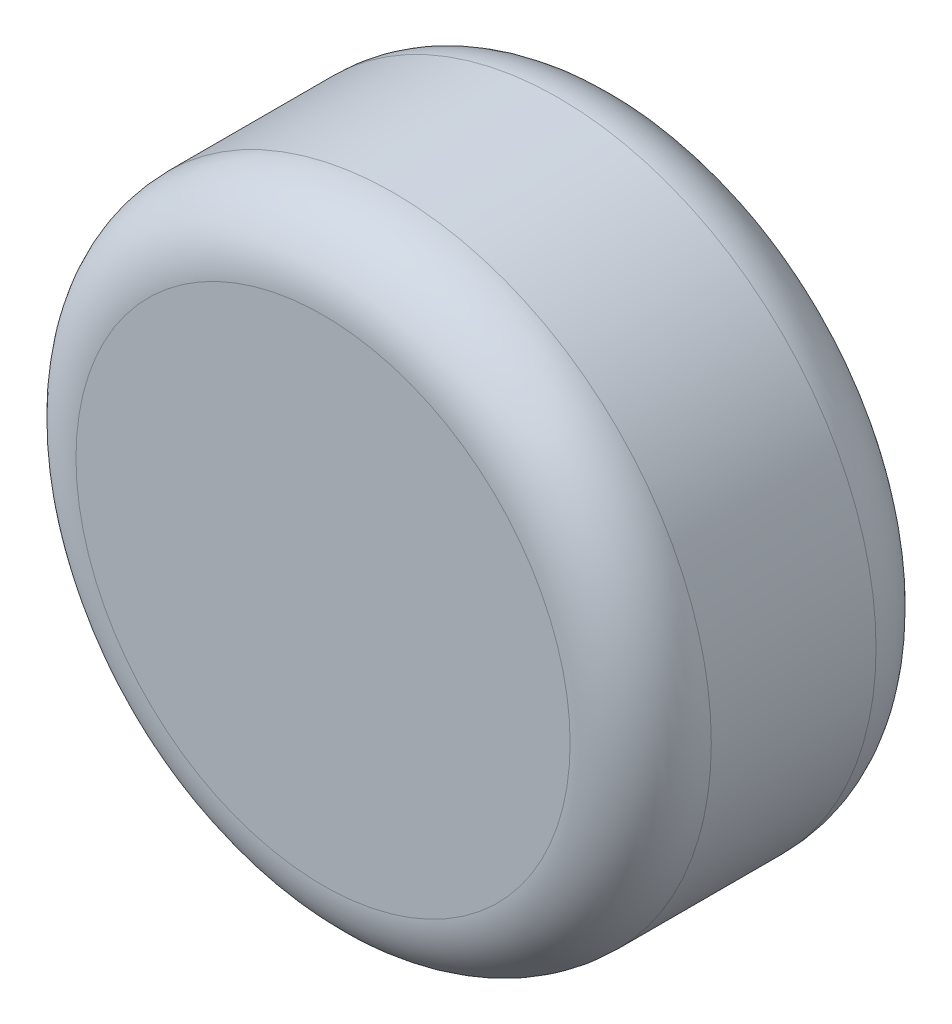
ISO-10303-21;
HEADER;
FILE_DESCRIPTION(('STEP AP214'),'2;1');
FILE_NAME('part.step','',(''),(''),'','','');
FILE_SCHEMA(('AUTOMOTIVE_DESIGN { 1 0 10303 214 1 1 1 1 }'));
ENDSEC;
DATA;
#1=APPLICATION_CONTEXT('core data for automotive mechanical design processes');
#2=APPLICATION_PROTOCOL_DEFINITION('international standard','automotive_design',2000,#1);
#3=PRODUCT_CONTEXT('',#1,'mechanical');
#4=PRODUCT('Part','Part','',(#3));
#5=PRODUCT_RELATED_PRODUCT_CATEGORY('part','',(#4));
#6=PRODUCT_DEFINITION_FORMATION('','',#4);
#7=PRODUCT_DEFINITION_CONTEXT('part definition',#1,'design');
#8=PRODUCT_DEFINITION('design','',#6,#7);
#9=PRODUCT_DEFINITION_SHAPE('','',#8);
#10=(LENGTH_UNIT() NAMED_UNIT(*) SI_UNIT(.MILLI.,.METRE.));
#11=(NAMED_UNIT(*) PLANE_ANGLE_UNIT() SI_UNIT($,.RADIAN.));
#12=(NAMED_UNIT(*) SI_UNIT($,.STERADIAN.) SOLID_ANGLE_UNIT());
#13=UNCERTAINTY_MEASURE_WITH_UNIT(LENGTH_MEASURE(1.E-05),#10,'distance_accuracy_value','');
#14=(GEOMETRIC_REPRESENTATION_CONTEXT(3) GLOBAL_UNCERTAINTY_ASSIGNED_CONTEXT((#13)) GLOBAL_UNIT_ASSIGNED_CONTEXT((#10,
#11,#12)) REPRESENTATION_CONTEXT('',''));
#15=CARTESIAN_POINT('',(0.,0.,0.));
#16=DIRECTION('',(0.,0.,1.));
#17=DIRECTION('',(1.,0.,0.));
#18=AXIS2_PLACEMENT_3D('',#15,#16,#17);
#19=CARTESIAN_POINT('',(0.,0.,65.));
#20=DIRECTION('',(0.,0.,-1.));
#21=DIRECTION('',(-1.,0.,0.));
#22=AXIS2_PLACEMENT_3D('',#19,#20,#21);
#23=CYLINDRICAL_SURFACE('',#22,67.5);
#24=CARTESIAN_POINT('',(0.,0.,15.));
#25=DIRECTION('',(0.,0.,1.));
#26=DIRECTION('',(1.,0.,0.));
#27=AXIS2_PLACEMENT_3D('',#24,#25,#26);
#28=CIRCLE('',#27,67.5);
#29=CARTESIAN_POINT('',(67.5,0.,15.));
#30=VERTEX_POINT('',#29);
#31=EDGE_CURVE('E42',#30,#30,#28,.T.);
#32=ORIENTED_EDGE('',*,*,#31,.T.);
#33=EDGE_LOOP('',(#32));
#34=FACE_BOUND('',#33,.T.);
#35=CARTESIAN_POINT('',(0.,0.,50.));
#36=DIRECTION('',(0.,0.,1.));
#37=DIRECTION('',(1.,0.,0.));
#38=AXIS2_PLACEMENT_3D('',#35,#36,#37);
#39=CIRCLE('',#38,67.5);
#40=CARTESIAN_POINT('',(67.5,0.,50.));
#41=VERTEX_POINT('',#40);
#42=EDGE_CURVE('E46',#41,#41,#39,.F.);
#43=ORIENTED_EDGE('',*,*,#42,.T.);
#44=EDGE_LOOP('',(#43));
#45=FACE_BOUND('',#44,.T.);
#46=ADVANCED_FACE('F31',(#34,#45),#23,.T.);
#47=CARTESIAN_POINT('',(0.,0.,65.));
#48=DIRECTION('',(0.,0.,1.));
#49=DIRECTION('',(1.,0.,0.));
#50=AXIS2_PLACEMENT_3D('',#47,#48,#49);
#51=PLANE('',#50);
#52=CARTESIAN_POINT('',(0.,0.,65.));
#53=DIRECTION('',(0.,0.,1.));
#54=DIRECTION('',(1.,0.,0.));
#55=AXIS2_PLACEMENT_3D('',#52,#53,#54);
#56=CIRCLE('',#55,52.5);
#57=CARTESIAN_POINT('',(52.5,0.,65.));
#58=VERTEX_POINT('',#57);
#59=EDGE_CURVE('E10',#58,#58,#56,.T.);
#60=ORIENTED_EDGE('',*,*,#59,.T.);
#61=EDGE_LOOP('',(#60));
#62=FACE_BOUND('',#61,.T.);
#63=ADVANCED_FACE('F62',(#62),#51,.T.);
#64=CARTESIAN_POINT('',(0.,0.,0.));
#65=DIRECTION('',(0.,0.,1.));
#66=DIRECTION('',(1.,0.,0.));
#67=AXIS2_PLACEMENT_3D('',#64,#65,#66);
#68=PLANE('',#67);
#69=CARTESIAN_POINT('',(0.,0.,0.));
#70=DIRECTION('',(0.,0.,1.));
#71=DIRECTION('',(1.,0.,0.));
#72=AXIS2_PLACEMENT_3D('',#69,#70,#71);
#73=CIRCLE('',#72,52.5);
#74=CARTESIAN_POINT('',(52.5,0.,0.));
#75=VERTEX_POINT('',#74);
#76=EDGE_CURVE('E38',#75,#75,#73,.F.);
#77=ORIENTED_EDGE('',*,*,#76,.T.);
#78=EDGE_LOOP('',(#77));
#79=FACE_BOUND('',#78,.T.);
#80=ADVANCED_FACE('F59',(#79),#68,.F.);
#81=CARTESIAN_POINT('',(0.,0.,15.));
#82=DIRECTION('',(0.,0.,1.));
#83=DIRECTION('',(1.,0.,0.));
#84=AXIS2_PLACEMENT_3D('',#81,#82,#83);
#85=TOROIDAL_SURFACE('',#84,52.5,15.);
#86=ORIENTED_EDGE('',*,*,#76,.F.);
#87=EDGE_LOOP('',(#86));
#88=FACE_BOUND('',#87,.T.);
#89=ORIENTED_EDGE('',*,*,#31,.F.);
#90=EDGE_LOOP('',(#89));
#91=FACE_BOUND('',#90,.T.);
#92=ADVANCED_FACE('F55',(#88,#91),#85,.T.);
#93=CARTESIAN_POINT('',(0.,0.,50.));
#94=DIRECTION('',(0.,0.,1.));
#95=DIRECTION('',(1.,0.,0.));
#96=AXIS2_PLACEMENT_3D('',#93,#94,#95);
#97=TOROIDAL_SURFACE('',#96,52.5,15.);
#98=ORIENTED_EDGE('',*,*,#42,.F.);
#99=EDGE_LOOP('',(#98));
#100=FACE_BOUND('',#99,.T.);
#101=ORIENTED_EDGE('',*,*,#59,.F.);
#102=EDGE_LOOP('',(#101));
#103=FACE_BOUND('',#102,.T.);
#104=ADVANCED_FACE('F33',(#100,#103),#97,.T.);
#105=CLOSED_SHELL('',(#46,#63,#80,#92,#104));
#106=MANIFOLD_SOLID_BREP('B2',#105);
#107=ADVANCED_BREP_SHAPE_REPRESENTATION('',(#18,#106),#14);
#108=SHAPE_DEFINITION_REPRESENTATION(#9,#107);
ENDSEC;
END-ISO-10303-21;
